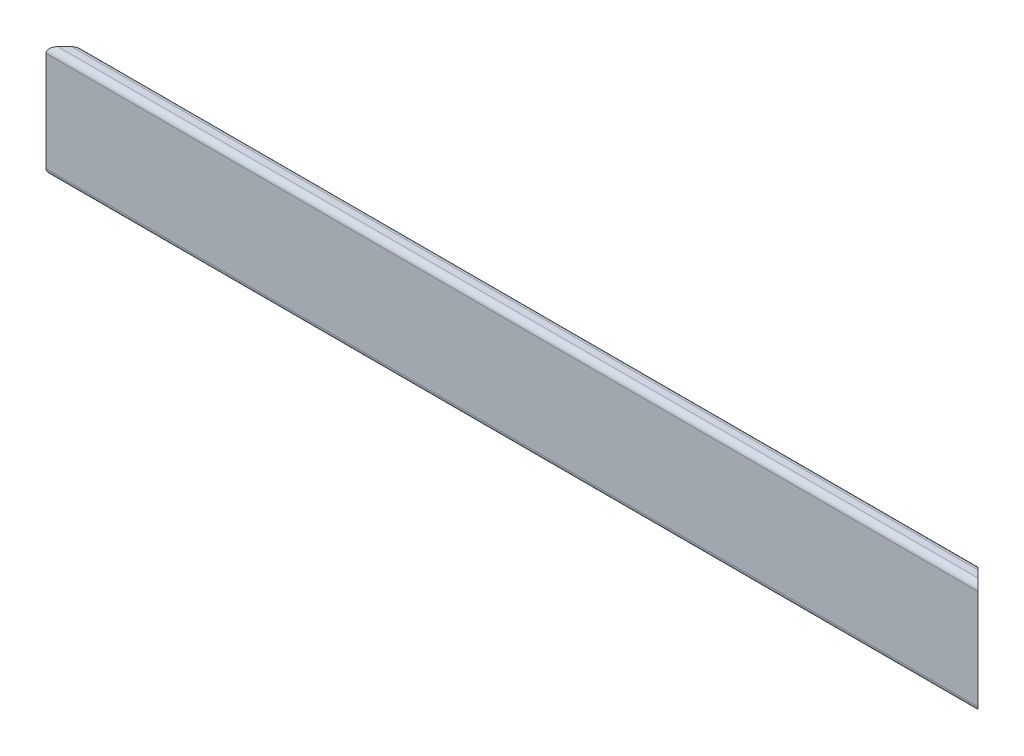
ISO-10303-21;
HEADER;
FILE_DESCRIPTION(('STEP AP214'),'2;1');
FILE_NAME('part.step','',(''),(''),'','','');
FILE_SCHEMA(('AUTOMOTIVE_DESIGN { 1 0 10303 214 1 1 1 1 }'));
ENDSEC;
DATA;
#1=APPLICATION_CONTEXT('core data for automotive mechanical design processes');
#2=APPLICATION_PROTOCOL_DEFINITION('international standard','automotive_design',2000,#1);
#3=PRODUCT_CONTEXT('',#1,'mechanical');
#4=PRODUCT('Part','Part','',(#3));
#5=PRODUCT_RELATED_PRODUCT_CATEGORY('part','',(#4));
#6=PRODUCT_DEFINITION_FORMATION('','',#4);
#7=PRODUCT_DEFINITION_CONTEXT('part definition',#1,'design');
#8=PRODUCT_DEFINITION('design','',#6,#7);
#9=PRODUCT_DEFINITION_SHAPE('','',#8);
#10=(LENGTH_UNIT() NAMED_UNIT(*) SI_UNIT(.MILLI.,.METRE.));
#11=(NAMED_UNIT(*) PLANE_ANGLE_UNIT() SI_UNIT($,.RADIAN.));
#12=(NAMED_UNIT(*) SI_UNIT($,.STERADIAN.) SOLID_ANGLE_UNIT());
#13=UNCERTAINTY_MEASURE_WITH_UNIT(LENGTH_MEASURE(1.E-05),#10,'distance_accuracy_value','');
#14=(GEOMETRIC_REPRESENTATION_CONTEXT(3) GLOBAL_UNCERTAINTY_ASSIGNED_CONTEXT((#13)) GLOBAL_UNIT_ASSIGNED_CONTEXT((#10,
#11,#12)) REPRESENTATION_CONTEXT('',''));
#15=CARTESIAN_POINT('',(0.,0.,0.));
#16=DIRECTION('',(0.,0.,1.));
#17=DIRECTION('',(1.,0.,0.));
#18=AXIS2_PLACEMENT_3D('',#15,#16,#17);
#19=CARTESIAN_POINT('',(-159.35,19.05,6.35000000000004));
#20=DIRECTION('',(0.707106781186544,0.,0.707106781186551));
#21=DIRECTION('',(0.707106781186551,0.,-0.707106781186544));
#22=AXIS2_PLACEMENT_3D('',#19,#20,#21);
#23=PLANE('',#22);
#24=DIRECTION('',(-0.707106781186551,0.,0.707106781186544));
#25=VECTOR('',#24,1.);
#26=CARTESIAN_POINT('',(-159.35,-19.05,6.35000000000004));
#27=LINE('',#26,#25);
#28=CARTESIAN_POINT('',(-153.,-19.05,0.));
#29=VERTEX_POINT('',#28);
#30=CARTESIAN_POINT('',(-157.35,-19.05,4.35000000000003));
#31=VERTEX_POINT('',#30);
#32=EDGE_CURVE('E122',#29,#31,#27,.T.);
#33=ORIENTED_EDGE('',*,*,#32,.T.);
#34=CARTESIAN_POINT('',(-157.35,-17.05,4.35000000000004));
#35=DIRECTION('',(0.707106781186544,0.,0.707106781186551));
#36=DIRECTION('',(-0.707106781186551,0.,0.707106781186544));
#37=AXIS2_PLACEMENT_3D('',#34,#35,#36);
#38=ELLIPSE('',#37,2.82842712474621,2.);
#39=CARTESIAN_POINT('',(-159.35,-17.05,6.35000000000004));
#40=VERTEX_POINT('',#39);
#41=EDGE_CURVE('E164',#31,#40,#38,.F.);
#42=ORIENTED_EDGE('',*,*,#41,.T.);
#43=DIRECTION('',(0.,-1.,0.));
#44=VECTOR('',#43,1.);
#45=CARTESIAN_POINT('',(-159.35,19.05,6.35000000000004));
#46=LINE('',#45,#44);
#47=CARTESIAN_POINT('',(-159.35,17.05,6.35000000000004));
#48=VERTEX_POINT('',#47);
#49=EDGE_CURVE('E138',#48,#40,#46,.T.);
#50=ORIENTED_EDGE('',*,*,#49,.F.);
#51=CARTESIAN_POINT('',(-157.35,17.05,4.35000000000004));
#52=DIRECTION('',(0.707106781186544,0.,0.707106781186551));
#53=DIRECTION('',(0.707106781186551,0.,-0.707106781186544));
#54=AXIS2_PLACEMENT_3D('',#51,#52,#53);
#55=ELLIPSE('',#54,2.82842712474621,2.);
#56=CARTESIAN_POINT('',(-157.35,19.05,4.35000000000003));
#57=VERTEX_POINT('',#56);
#58=EDGE_CURVE('E64',#48,#57,#55,.F.);
#59=ORIENTED_EDGE('',*,*,#58,.T.);
#60=DIRECTION('',(-0.707106781186551,0.,0.707106781186544));
#61=VECTOR('',#60,1.);
#62=CARTESIAN_POINT('',(-159.35,19.05,6.35000000000004));
#63=LINE('',#62,#61);
#64=CARTESIAN_POINT('',(-155.,19.05,2.));
#65=VERTEX_POINT('',#64);
#66=EDGE_CURVE('E127',#65,#57,#63,.T.);
#67=ORIENTED_EDGE('',*,*,#66,.F.);
#68=CARTESIAN_POINT('',(-155.,17.05,2.));
#69=DIRECTION('',(0.707106781186544,0.,0.707106781186551));
#70=DIRECTION('',(-0.707106781186551,0.,0.707106781186544));
#71=AXIS2_PLACEMENT_3D('',#68,#69,#70);
#72=ELLIPSE('',#71,2.82842712474621,2.);
#73=CARTESIAN_POINT('',(-153.,17.05,0.));
#74=VERTEX_POINT('',#73);
#75=EDGE_CURVE('E58',#65,#74,#72,.F.);
#76=ORIENTED_EDGE('',*,*,#75,.T.);
#77=DIRECTION('',(0.,-1.,0.));
#78=VECTOR('',#77,1.);
#79=CARTESIAN_POINT('',(-153.,19.05,0.));
#80=LINE('',#79,#78);
#81=EDGE_CURVE('E112',#74,#29,#80,.T.);
#82=ORIENTED_EDGE('',*,*,#81,.T.);
#83=EDGE_LOOP('',(#33,#42,#50,#59,#67,#76,#82));
#84=FACE_BOUND('',#83,.T.);
#85=ADVANCED_FACE('F42',(#84),#23,.F.);
#86=CARTESIAN_POINT('',(159.35,19.05,6.35));
#87=DIRECTION('',(0.,0.,-1.));
#88=DIRECTION('',(-1.,0.,0.));
#89=AXIS2_PLACEMENT_3D('',#86,#87,#88);
#90=PLANE('',#89);
#91=ORIENTED_EDGE('',*,*,#49,.T.);
#92=DIRECTION('',(1.,0.,0.));
#93=VECTOR('',#92,1.);
#94=CARTESIAN_POINT('',(159.35,-17.05,6.35));
#95=LINE('',#94,#93);
#96=CARTESIAN_POINT('',(159.35,-17.05,6.35));
#97=VERTEX_POINT('',#96);
#98=EDGE_CURVE('E145',#40,#97,#95,.T.);
#99=ORIENTED_EDGE('',*,*,#98,.T.);
#100=DIRECTION('',(0.,-1.,0.));
#101=VECTOR('',#100,1.);
#102=CARTESIAN_POINT('',(159.35,19.05,6.35));
#103=LINE('',#102,#101);
#104=CARTESIAN_POINT('',(159.35,17.05,6.35));
#105=VERTEX_POINT('',#104);
#106=EDGE_CURVE('E111',#105,#97,#103,.T.);
#107=ORIENTED_EDGE('',*,*,#106,.F.);
#108=DIRECTION('',(1.,0.,0.));
#109=VECTOR('',#108,1.);
#110=CARTESIAN_POINT('',(159.35,17.05,6.35));
#111=LINE('',#110,#109);
#112=EDGE_CURVE('E142',#105,#48,#111,.F.);
#113=ORIENTED_EDGE('',*,*,#112,.T.);
#114=EDGE_LOOP('',(#91,#99,#107,#113));
#115=FACE_BOUND('',#114,.T.);
#116=ADVANCED_FACE('F188',(#115),#90,.F.);
#117=CARTESIAN_POINT('',(153.,19.05,0.));
#118=DIRECTION('',(-0.707106781186543,0.,0.707106781186552));
#119=DIRECTION('',(0.707106781186552,0.,0.707106781186543));
#120=AXIS2_PLACEMENT_3D('',#117,#118,#119);
#121=PLANE('',#120);
#122=ORIENTED_EDGE('',*,*,#106,.T.);
#123=CARTESIAN_POINT('',(157.35,-17.05,4.35));
#124=DIRECTION('',(-0.707106781186543,0.,0.707106781186552));
#125=DIRECTION('',(-0.707106781186552,0.,-0.707106781186543));
#126=AXIS2_PLACEMENT_3D('',#123,#124,#125);
#127=ELLIPSE('',#126,2.82842712474621,2.);
#128=CARTESIAN_POINT('',(157.35,-19.05,4.35));
#129=VERTEX_POINT('',#128);
#130=EDGE_CURVE('E118',#97,#129,#127,.F.);
#131=ORIENTED_EDGE('',*,*,#130,.T.);
#132=DIRECTION('',(-0.707106781186552,0.,-0.707106781186543));
#133=VECTOR('',#132,1.);
#134=CARTESIAN_POINT('',(153.,-19.05,0.));
#135=LINE('',#134,#133);
#136=CARTESIAN_POINT('',(153.,-19.05,0.));
#137=VERTEX_POINT('',#136);
#138=EDGE_CURVE('E115',#129,#137,#135,.T.);
#139=ORIENTED_EDGE('',*,*,#138,.T.);
#140=DIRECTION('',(0.,-1.,0.));
#141=VECTOR('',#140,1.);
#142=CARTESIAN_POINT('',(153.,19.05,0.));
#143=LINE('',#142,#141);
#144=CARTESIAN_POINT('',(153.,17.05,0.));
#145=VERTEX_POINT('',#144);
#146=EDGE_CURVE('E101',#145,#137,#143,.T.);
#147=ORIENTED_EDGE('',*,*,#146,.F.);
#148=CARTESIAN_POINT('',(155.,17.05,1.99999999999994));
#149=DIRECTION('',(-0.707106781186543,0.,0.707106781186552));
#150=DIRECTION('',(-0.707106781186552,0.,-0.707106781186543));
#151=AXIS2_PLACEMENT_3D('',#148,#149,#150);
#152=ELLIPSE('',#151,2.82842712474621,2.);
#153=CARTESIAN_POINT('',(155.,19.05,1.99999999999995));
#154=VERTEX_POINT('',#153);
#155=EDGE_CURVE('E149',#145,#154,#152,.F.);
#156=ORIENTED_EDGE('',*,*,#155,.T.);
#157=DIRECTION('',(-0.707106781186552,0.,-0.707106781186543));
#158=VECTOR('',#157,1.);
#159=CARTESIAN_POINT('',(153.,19.05,0.));
#160=LINE('',#159,#158);
#161=CARTESIAN_POINT('',(157.35,19.05,4.35));
#162=VERTEX_POINT('',#161);
#163=EDGE_CURVE('E130',#162,#154,#160,.T.);
#164=ORIENTED_EDGE('',*,*,#163,.F.);
#165=CARTESIAN_POINT('',(157.35,17.05,4.35));
#166=DIRECTION('',(-0.707106781186543,0.,0.707106781186552));
#167=DIRECTION('',(0.707106781186552,0.,0.707106781186543));
#168=AXIS2_PLACEMENT_3D('',#165,#166,#167);
#169=ELLIPSE('',#168,2.82842712474621,2.);
#170=EDGE_CURVE('E152',#162,#105,#169,.F.);
#171=ORIENTED_EDGE('',*,*,#170,.T.);
#172=EDGE_LOOP('',(#122,#131,#139,#147,#156,#164,#171));
#173=FACE_BOUND('',#172,.T.);
#174=ADVANCED_FACE('F117',(#173),#121,.F.);
#175=CARTESIAN_POINT('',(-153.,19.05,0.));
#176=DIRECTION('',(0.,0.,1.));
#177=DIRECTION('',(1.,0.,0.));
#178=AXIS2_PLACEMENT_3D('',#175,#176,#177);
#179=PLANE('',#178);
#180=ORIENTED_EDGE('',*,*,#81,.F.);
#181=DIRECTION('',(-1.,0.,0.));
#182=VECTOR('',#181,1.);
#183=CARTESIAN_POINT('',(-153.,17.05,0.));
#184=LINE('',#183,#182);
#185=EDGE_CURVE('E11',#74,#145,#184,.F.);
#186=ORIENTED_EDGE('',*,*,#185,.T.);
#187=ORIENTED_EDGE('',*,*,#146,.T.);
#188=DIRECTION('',(-1.,0.,0.));
#189=VECTOR('',#188,1.);
#190=CARTESIAN_POINT('',(-153.,-19.05,0.));
#191=LINE('',#190,#189);
#192=EDGE_CURVE('E105',#137,#29,#191,.T.);
#193=ORIENTED_EDGE('',*,*,#192,.T.);
#194=EDGE_LOOP('',(#180,#186,#187,#193));
#195=FACE_BOUND('',#194,.T.);
#196=ADVANCED_FACE('F103',(#195),#179,.F.);
#197=CARTESIAN_POINT('',(0.,19.05,0.));
#198=DIRECTION('',(0.,-1.,0.));
#199=DIRECTION('',(0.,0.,-1.));
#200=AXIS2_PLACEMENT_3D('',#197,#198,#199);
#201=PLANE('',#200);
#202=ORIENTED_EDGE('',*,*,#66,.T.);
#203=DIRECTION('',(1.,0.,0.));
#204=VECTOR('',#203,1.);
#205=CARTESIAN_POINT('',(0.,19.05,4.35000000000002));
#206=LINE('',#205,#204);
#207=EDGE_CURVE('E51',#57,#162,#206,.T.);
#208=ORIENTED_EDGE('',*,*,#207,.T.);
#209=ORIENTED_EDGE('',*,*,#163,.T.);
#210=DIRECTION('',(-1.,0.,0.));
#211=VECTOR('',#210,1.);
#212=CARTESIAN_POINT('',(0.,19.05,1.99999999999997));
#213=LINE('',#212,#211);
#214=EDGE_CURVE('E167',#154,#65,#213,.T.);
#215=ORIENTED_EDGE('',*,*,#214,.T.);
#216=EDGE_LOOP('',(#202,#208,#209,#215));
#217=FACE_BOUND('',#216,.T.);
#218=ADVANCED_FACE('F176',(#217),#201,.F.);
#219=CARTESIAN_POINT('',(0.,-19.05,0.));
#220=DIRECTION('',(0.,-1.,0.));
#221=DIRECTION('',(0.,0.,-1.));
#222=AXIS2_PLACEMENT_3D('',#219,#220,#221);
#223=PLANE('',#222);
#224=ORIENTED_EDGE('',*,*,#138,.F.);
#225=DIRECTION('',(1.,0.,0.));
#226=VECTOR('',#225,1.);
#227=CARTESIAN_POINT('',(-159.35,-19.05,4.35000000000004));
#228=LINE('',#227,#226);
#229=EDGE_CURVE('E157',#129,#31,#228,.F.);
#230=ORIENTED_EDGE('',*,*,#229,.T.);
#231=ORIENTED_EDGE('',*,*,#32,.F.);
#232=ORIENTED_EDGE('',*,*,#192,.F.);
#233=EDGE_LOOP('',(#224,#230,#231,#232));
#234=FACE_BOUND('',#233,.T.);
#235=ADVANCED_FACE('F124',(#234),#223,.T.);
#236=CARTESIAN_POINT('',(159.35,-17.05,4.35));
#237=DIRECTION('',(-1.,0.,0.));
#238=DIRECTION('',(0.,0.,1.));
#239=AXIS2_PLACEMENT_3D('',#236,#237,#238);
#240=CYLINDRICAL_SURFACE('',#239,2.);
#241=ORIENTED_EDGE('',*,*,#41,.F.);
#242=ORIENTED_EDGE('',*,*,#229,.F.);
#243=ORIENTED_EDGE('',*,*,#130,.F.);
#244=ORIENTED_EDGE('',*,*,#98,.F.);
#245=EDGE_LOOP('',(#241,#242,#243,#244));
#246=FACE_BOUND('',#245,.T.);
#247=ADVANCED_FACE('F186',(#246),#240,.T.);
#248=CARTESIAN_POINT('',(0.,17.05,4.35000000000002));
#249=DIRECTION('',(1.,0.,0.));
#250=DIRECTION('',(0.,0.,-1.));
#251=AXIS2_PLACEMENT_3D('',#248,#249,#250);
#252=CYLINDRICAL_SURFACE('',#251,2.);
#253=ORIENTED_EDGE('',*,*,#58,.F.);
#254=ORIENTED_EDGE('',*,*,#112,.F.);
#255=ORIENTED_EDGE('',*,*,#170,.F.);
#256=ORIENTED_EDGE('',*,*,#207,.F.);
#257=EDGE_LOOP('',(#253,#254,#255,#256));
#258=FACE_BOUND('',#257,.T.);
#259=ADVANCED_FACE('F190',(#258),#252,.T.);
#260=CARTESIAN_POINT('',(0.,17.05,1.99999999999997));
#261=DIRECTION('',(-1.,0.,0.));
#262=DIRECTION('',(0.,0.,1.));
#263=AXIS2_PLACEMENT_3D('',#260,#261,#262);
#264=CYLINDRICAL_SURFACE('',#263,2.);
#265=ORIENTED_EDGE('',*,*,#155,.F.);
#266=ORIENTED_EDGE('',*,*,#185,.F.);
#267=ORIENTED_EDGE('',*,*,#75,.F.);
#268=ORIENTED_EDGE('',*,*,#214,.F.);
#269=EDGE_LOOP('',(#265,#266,#267,#268));
#270=FACE_BOUND('',#269,.T.);
#271=ADVANCED_FACE('F44',(#270),#264,.T.);
#272=CLOSED_SHELL('',(#85,#116,#174,#196,#218,#235,#247,#259,#271));
#273=MANIFOLD_SOLID_BREP('B2',#272);
#274=ADVANCED_BREP_SHAPE_REPRESENTATION('',(#18,#273),#14);
#275=SHAPE_DEFINITION_REPRESENTATION(#9,#274);
ENDSEC;
END-ISO-10303-21;
